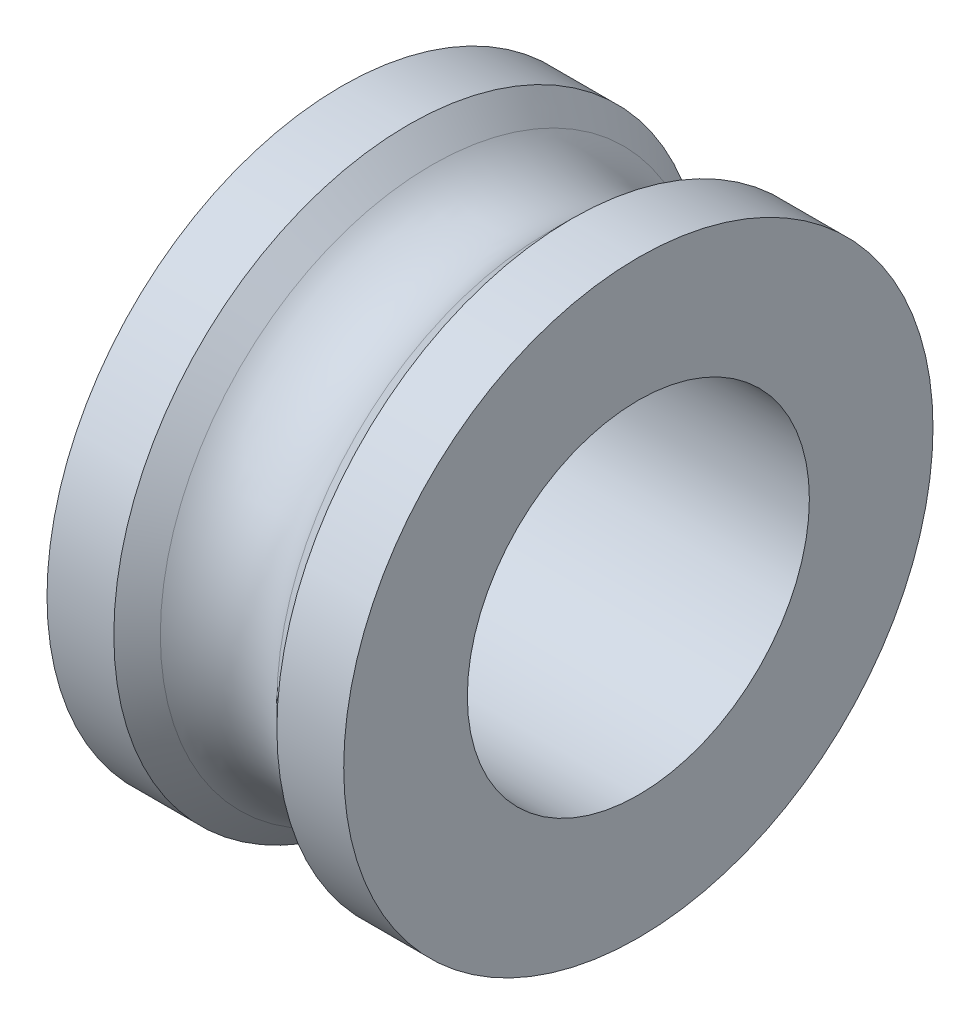
ISO-10303-21;
HEADER;
FILE_DESCRIPTION(('STEP AP214'),'2;1');
FILE_NAME('part.step','',(''),(''),'','','');
FILE_SCHEMA(('AUTOMOTIVE_DESIGN { 1 0 10303 214 1 1 1 1 }'));
ENDSEC;
DATA;
#1=APPLICATION_CONTEXT('core data for automotive mechanical design processes');
#2=APPLICATION_PROTOCOL_DEFINITION('international standard','automotive_design',2000,#1);
#3=PRODUCT_CONTEXT('',#1,'mechanical');
#4=PRODUCT('Part','Part','',(#3));
#5=PRODUCT_RELATED_PRODUCT_CATEGORY('part','',(#4));
#6=PRODUCT_DEFINITION_FORMATION('','',#4);
#7=PRODUCT_DEFINITION_CONTEXT('part definition',#1,'design');
#8=PRODUCT_DEFINITION('design','',#6,#7);
#9=PRODUCT_DEFINITION_SHAPE('','',#8);
#10=(LENGTH_UNIT() NAMED_UNIT(*) SI_UNIT(.MILLI.,.METRE.));
#11=(NAMED_UNIT(*) PLANE_ANGLE_UNIT() SI_UNIT($,.RADIAN.));
#12=(NAMED_UNIT(*) SI_UNIT($,.STERADIAN.) SOLID_ANGLE_UNIT());
#13=UNCERTAINTY_MEASURE_WITH_UNIT(LENGTH_MEASURE(1.E-05),#10,'distance_accuracy_value','');
#14=(GEOMETRIC_REPRESENTATION_CONTEXT(3) GLOBAL_UNCERTAINTY_ASSIGNED_CONTEXT((#13)) GLOBAL_UNIT_ASSIGNED_CONTEXT((#10,
#11,#12)) REPRESENTATION_CONTEXT('',''));
#15=CARTESIAN_POINT('',(0.,0.,0.));
#16=DIRECTION('',(0.,0.,1.));
#17=DIRECTION('',(1.,0.,0.));
#18=AXIS2_PLACEMENT_3D('',#15,#16,#17);
#19=CARTESIAN_POINT('',(0.,0.,0.));
#20=DIRECTION('',(1.,0.,0.));
#21=DIRECTION('',(0.,0.,-1.));
#22=AXIS2_PLACEMENT_3D('',#19,#20,#21);
#23=TOROIDAL_SURFACE('',#22,4.,0.999999999999997);
#24=CARTESIAN_POINT('',(-0.707106781186547,0.,0.));
#25=DIRECTION('',(1.,0.,0.));
#26=DIRECTION('',(0.,0.,-1.));
#27=AXIS2_PLACEMENT_3D('',#24,#25,#26);
#28=CIRCLE('',#27,3.29289321881346);
#29=CARTESIAN_POINT('',(-0.707106781186547,0.,-3.29289321881346));
#30=VERTEX_POINT('',#29);
#31=EDGE_CURVE('E10',#30,#30,#28,.T.);
#32=ORIENTED_EDGE('',*,*,#31,.T.);
#33=EDGE_LOOP('',(#32));
#34=FACE_BOUND('',#33,.T.);
#35=CARTESIAN_POINT('',(0.707106781186547,0.,0.));
#36=DIRECTION('',(1.,0.,0.));
#37=DIRECTION('',(0.,0.,-1.));
#38=AXIS2_PLACEMENT_3D('',#35,#36,#37);
#39=CIRCLE('',#38,3.29289321881345);
#40=CARTESIAN_POINT('',(0.707106781186547,0.,-3.29289321881345));
#41=VERTEX_POINT('',#40);
#42=EDGE_CURVE('E60',#41,#41,#39,.T.);
#43=ORIENTED_EDGE('',*,*,#42,.F.);
#44=EDGE_LOOP('',(#43));
#45=FACE_BOUND('',#44,.T.);
#46=ADVANCED_FACE('F32',(#34,#45),#23,.F.);
#47=CARTESIAN_POINT('',(-0.707106781186547,0.,0.));
#48=DIRECTION('',(-1.,0.,0.));
#49=DIRECTION('',(0.,0.,1.));
#50=AXIS2_PLACEMENT_3D('',#47,#48,#49);
#51=CONICAL_SURFACE('',#50,3.29289321881346,0.785398163397448);
#52=CARTESIAN_POINT('',(-0.989213562373093,0.,0.));
#53=DIRECTION('',(1.,0.,0.));
#54=DIRECTION('',(0.,0.,-1.));
#55=AXIS2_PLACEMENT_3D('',#52,#53,#54);
#56=CIRCLE('',#55,3.575);
#57=CARTESIAN_POINT('',(-0.989213562373093,0.,-3.575));
#58=VERTEX_POINT('',#57);
#59=EDGE_CURVE('E38',#58,#58,#56,.T.);
#60=ORIENTED_EDGE('',*,*,#59,.T.);
#61=EDGE_LOOP('',(#60));
#62=FACE_BOUND('',#61,.T.);
#63=ORIENTED_EDGE('',*,*,#31,.F.);
#64=EDGE_LOOP('',(#63));
#65=FACE_BOUND('',#64,.T.);
#66=ADVANCED_FACE('F68',(#62,#65),#51,.T.);
#67=CARTESIAN_POINT('',(12.1559414941494,0.,0.));
#68=DIRECTION('',(1.,0.,0.));
#69=DIRECTION('',(0.,0.,-1.));
#70=AXIS2_PLACEMENT_3D('',#67,#68,#69);
#71=CYLINDRICAL_SURFACE('',#70,3.575);
#72=CARTESIAN_POINT('',(-1.8,0.,0.));
#73=DIRECTION('',(1.,0.,0.));
#74=DIRECTION('',(0.,0.,-1.));
#75=AXIS2_PLACEMENT_3D('',#72,#73,#74);
#76=CIRCLE('',#75,3.575);
#77=CARTESIAN_POINT('',(-1.8,0.,-3.575));
#78=VERTEX_POINT('',#77);
#79=EDGE_CURVE('E42',#78,#78,#76,.T.);
#80=ORIENTED_EDGE('',*,*,#79,.T.);
#81=EDGE_LOOP('',(#80));
#82=FACE_BOUND('',#81,.T.);
#83=ORIENTED_EDGE('',*,*,#59,.F.);
#84=EDGE_LOOP('',(#83));
#85=FACE_BOUND('',#84,.T.);
#86=ADVANCED_FACE('F72',(#82,#85),#71,.T.);
#87=CARTESIAN_POINT('',(-1.8,3.575,0.));
#88=DIRECTION('',(-1.,0.,0.));
#89=DIRECTION('',(0.,0.,1.));
#90=AXIS2_PLACEMENT_3D('',#87,#88,#89);
#91=PLANE('',#90);
#92=CARTESIAN_POINT('',(-1.8,0.,0.));
#93=DIRECTION('',(1.,0.,0.));
#94=DIRECTION('',(0.,0.,-1.));
#95=AXIS2_PLACEMENT_3D('',#92,#93,#94);
#96=CIRCLE('',#95,2.075);
#97=CARTESIAN_POINT('',(-1.8,0.,-2.075));
#98=VERTEX_POINT('',#97);
#99=EDGE_CURVE('E46',#98,#98,#96,.T.);
#100=ORIENTED_EDGE('',*,*,#99,.T.);
#101=EDGE_LOOP('',(#100));
#102=FACE_BOUND('',#101,.T.);
#103=ORIENTED_EDGE('',*,*,#79,.F.);
#104=EDGE_LOOP('',(#103));
#105=FACE_BOUND('',#104,.T.);
#106=ADVANCED_FACE('F76',(#102,#105),#91,.T.);
#107=CARTESIAN_POINT('',(12.1559414941494,0.,0.));
#108=DIRECTION('',(1.,0.,0.));
#109=DIRECTION('',(0.,0.,-1.));
#110=AXIS2_PLACEMENT_3D('',#107,#108,#109);
#111=CYLINDRICAL_SURFACE('',#110,2.075);
#112=CARTESIAN_POINT('',(1.8,0.,0.));
#113=DIRECTION('',(1.,0.,0.));
#114=DIRECTION('',(0.,0.,-1.));
#115=AXIS2_PLACEMENT_3D('',#112,#113,#114);
#116=CIRCLE('',#115,2.075);
#117=CARTESIAN_POINT('',(1.8,0.,-2.075));
#118=VERTEX_POINT('',#117);
#119=EDGE_CURVE('E51',#118,#118,#116,.T.);
#120=ORIENTED_EDGE('',*,*,#119,.T.);
#121=EDGE_LOOP('',(#120));
#122=FACE_BOUND('',#121,.T.);
#123=ORIENTED_EDGE('',*,*,#99,.F.);
#124=EDGE_LOOP('',(#123));
#125=FACE_BOUND('',#124,.T.);
#126=ADVANCED_FACE('F83',(#122,#125),#111,.F.);
#127=CARTESIAN_POINT('',(1.8,2.075,0.));
#128=DIRECTION('',(1.,0.,0.));
#129=DIRECTION('',(0.,0.,-1.));
#130=AXIS2_PLACEMENT_3D('',#127,#128,#129);
#131=PLANE('',#130);
#132=CARTESIAN_POINT('',(1.8,0.,0.));
#133=DIRECTION('',(1.,0.,0.));
#134=DIRECTION('',(0.,0.,-1.));
#135=AXIS2_PLACEMENT_3D('',#132,#133,#134);
#136=CIRCLE('',#135,3.575);
#137=CARTESIAN_POINT('',(1.8,0.,-3.575));
#138=VERTEX_POINT('',#137);
#139=EDGE_CURVE('E54',#138,#138,#136,.T.);
#140=ORIENTED_EDGE('',*,*,#139,.T.);
#141=EDGE_LOOP('',(#140));
#142=FACE_BOUND('',#141,.T.);
#143=ORIENTED_EDGE('',*,*,#119,.F.);
#144=EDGE_LOOP('',(#143));
#145=FACE_BOUND('',#144,.T.);
#146=ADVANCED_FACE('F87',(#142,#145),#131,.T.);
#147=CARTESIAN_POINT('',(12.1559414941494,0.,0.));
#148=DIRECTION('',(1.,0.,0.));
#149=DIRECTION('',(0.,0.,-1.));
#150=AXIS2_PLACEMENT_3D('',#147,#148,#149);
#151=CYLINDRICAL_SURFACE('',#150,3.575);
#152=CARTESIAN_POINT('',(0.989213562373093,0.,0.));
#153=DIRECTION('',(1.,0.,0.));
#154=DIRECTION('',(0.,0.,-1.));
#155=AXIS2_PLACEMENT_3D('',#152,#153,#154);
#156=CIRCLE('',#155,3.575);
#157=CARTESIAN_POINT('',(0.989213562373093,0.,-3.575));
#158=VERTEX_POINT('',#157);
#159=EDGE_CURVE('E57',#158,#158,#156,.T.);
#160=ORIENTED_EDGE('',*,*,#159,.T.);
#161=EDGE_LOOP('',(#160));
#162=FACE_BOUND('',#161,.T.);
#163=ORIENTED_EDGE('',*,*,#139,.F.);
#164=EDGE_LOOP('',(#163));
#165=FACE_BOUND('',#164,.T.);
#166=ADVANCED_FACE('F91',(#162,#165),#151,.T.);
#167=CARTESIAN_POINT('',(0.989213562373093,0.,0.));
#168=DIRECTION('',(1.,0.,0.));
#169=DIRECTION('',(0.,0.,-1.));
#170=AXIS2_PLACEMENT_3D('',#167,#168,#169);
#171=CONICAL_SURFACE('',#170,3.575,0.785398163397448);
#172=ORIENTED_EDGE('',*,*,#42,.T.);
#173=EDGE_LOOP('',(#172));
#174=FACE_BOUND('',#173,.T.);
#175=ORIENTED_EDGE('',*,*,#159,.F.);
#176=EDGE_LOOP('',(#175));
#177=FACE_BOUND('',#176,.T.);
#178=ADVANCED_FACE('F64',(#174,#177),#171,.T.);
#179=CLOSED_SHELL('',(#46,#66,#86,#106,#126,#146,#166,#178));
#180=MANIFOLD_SOLID_BREP('B2',#179);
#181=ADVANCED_BREP_SHAPE_REPRESENTATION('',(#18,#180),#14);
#182=SHAPE_DEFINITION_REPRESENTATION(#9,#181);
ENDSEC;
END-ISO-10303-21;
